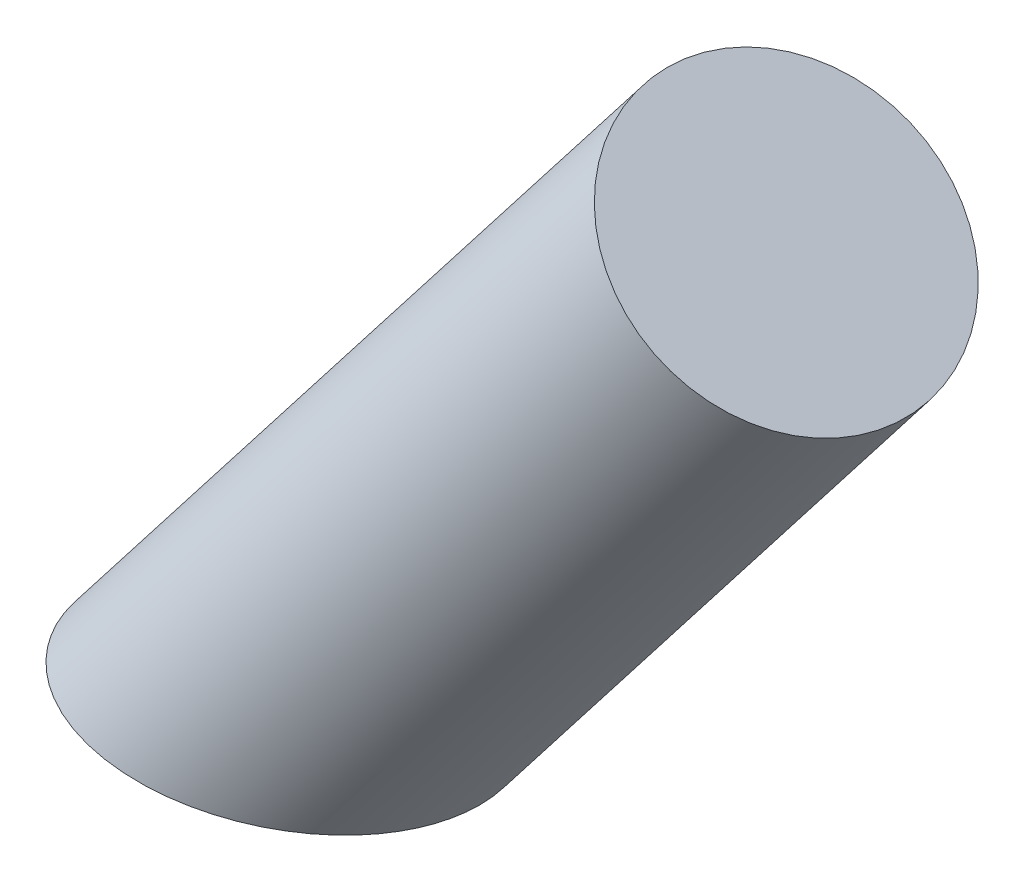
ISO-10303-21;
HEADER;
FILE_DESCRIPTION(('STEP AP214'),'2;1');
FILE_NAME('part.step','',(''),(''),'','','');
FILE_SCHEMA(('AUTOMOTIVE_DESIGN { 1 0 10303 214 1 1 1 1 }'));
ENDSEC;
DATA;
#1=APPLICATION_CONTEXT('core data for automotive mechanical design processes');
#2=APPLICATION_PROTOCOL_DEFINITION('international standard','automotive_design',2000,#1);
#3=PRODUCT_CONTEXT('',#1,'mechanical');
#4=PRODUCT('Part','Part','',(#3));
#5=PRODUCT_RELATED_PRODUCT_CATEGORY('part','',(#4));
#6=PRODUCT_DEFINITION_FORMATION('','',#4);
#7=PRODUCT_DEFINITION_CONTEXT('part definition',#1,'design');
#8=PRODUCT_DEFINITION('design','',#6,#7);
#9=PRODUCT_DEFINITION_SHAPE('','',#8);
#10=(LENGTH_UNIT() NAMED_UNIT(*) SI_UNIT(.MILLI.,.METRE.));
#11=(NAMED_UNIT(*) PLANE_ANGLE_UNIT() SI_UNIT($,.RADIAN.));
#12=(NAMED_UNIT(*) SI_UNIT($,.STERADIAN.) SOLID_ANGLE_UNIT());
#13=UNCERTAINTY_MEASURE_WITH_UNIT(LENGTH_MEASURE(1.E-05),#10,'distance_accuracy_value','');
#14=(GEOMETRIC_REPRESENTATION_CONTEXT(3) GLOBAL_UNCERTAINTY_ASSIGNED_CONTEXT((#13)) GLOBAL_UNIT_ASSIGNED_CONTEXT((#10,
#11,#12)) REPRESENTATION_CONTEXT('',''));
#15=CARTESIAN_POINT('',(0.,0.,0.));
#16=DIRECTION('',(0.,0.,1.));
#17=DIRECTION('',(1.,0.,0.));
#18=AXIS2_PLACEMENT_3D('',#15,#16,#17);
#19=CARTESIAN_POINT('',(-42.6007036764218,-54.8557006244336,0.));
#20=DIRECTION('',(0.613358757792434,0.789804427842312,0.));
#21=DIRECTION('',(-0.789804427842312,0.613358757792434,0.));
#22=AXIS2_PLACEMENT_3D('',#19,#20,#21);
#23=CYLINDRICAL_SURFACE('',#22,21.6721096980622);
#24=CARTESIAN_POINT('',(0.,0.,0.));
#25=DIRECTION('',(0.,1.,0.));
#26=DIRECTION('',(1.,0.,0.));
#27=AXIS2_PLACEMENT_3D('',#24,#25,#26);
#28=ELLIPSE('',#27,27.4398432498902,21.6721096980622);
#29=CARTESIAN_POINT('',(27.4398432498902,0.,0.));
#30=VERTEX_POINT('',#29);
#31=EDGE_CURVE('E10',#30,#30,#28,.F.);
#32=ORIENTED_EDGE('',*,*,#31,.F.);
#33=EDGE_LOOP('',(#32));
#34=FACE_BOUND('',#33,.T.);
#35=CARTESIAN_POINT('',(71.5442229905317,92.1254378234244,0.));
#36=DIRECTION('',(0.613358757792434,0.789804427842312,0.));
#37=DIRECTION('',(-0.789804427842312,0.613358757792434,0.));
#38=AXIS2_PLACEMENT_3D('',#35,#36,#37);
#39=CIRCLE('',#38,21.6721096980622);
#40=CARTESIAN_POINT('',(54.4274947903178,105.418216106569,0.));
#41=VERTEX_POINT('',#40);
#42=EDGE_CURVE('E39',#41,#41,#39,.T.);
#43=ORIENTED_EDGE('',*,*,#42,.F.);
#44=EDGE_LOOP('',(#43));
#45=FACE_BOUND('',#44,.T.);
#46=ADVANCED_FACE('F33',(#34,#45),#23,.T.);
#47=CARTESIAN_POINT('',(71.5442229905317,92.1254378234244,0.));
#48=DIRECTION('',(0.613358757792434,0.789804427842312,0.));
#49=DIRECTION('',(-0.789804427842312,0.613358757792434,0.));
#50=AXIS2_PLACEMENT_3D('',#47,#48,#49);
#51=PLANE('',#50);
#52=ORIENTED_EDGE('',*,*,#42,.T.);
#53=EDGE_LOOP('',(#52));
#54=FACE_BOUND('',#53,.T.);
#55=ADVANCED_FACE('F45',(#54),#51,.T.);
#56=CARTESIAN_POINT('',(0.,0.,0.));
#57=DIRECTION('',(0.,1.,0.));
#58=DIRECTION('',(0.,0.,1.));
#59=AXIS2_PLACEMENT_3D('',#56,#57,#58);
#60=PLANE('',#59);
#61=ORIENTED_EDGE('',*,*,#31,.T.);
#62=EDGE_LOOP('',(#61));
#63=FACE_BOUND('',#62,.T.);
#64=ADVANCED_FACE('F52',(#63),#60,.F.);
#65=CLOSED_SHELL('',(#46,#55,#64));
#66=MANIFOLD_SOLID_BREP('B2',#65);
#67=ADVANCED_BREP_SHAPE_REPRESENTATION('',(#18,#66),#14);
#68=SHAPE_DEFINITION_REPRESENTATION(#9,#67);
ENDSEC;
END-ISO-10303-21;
